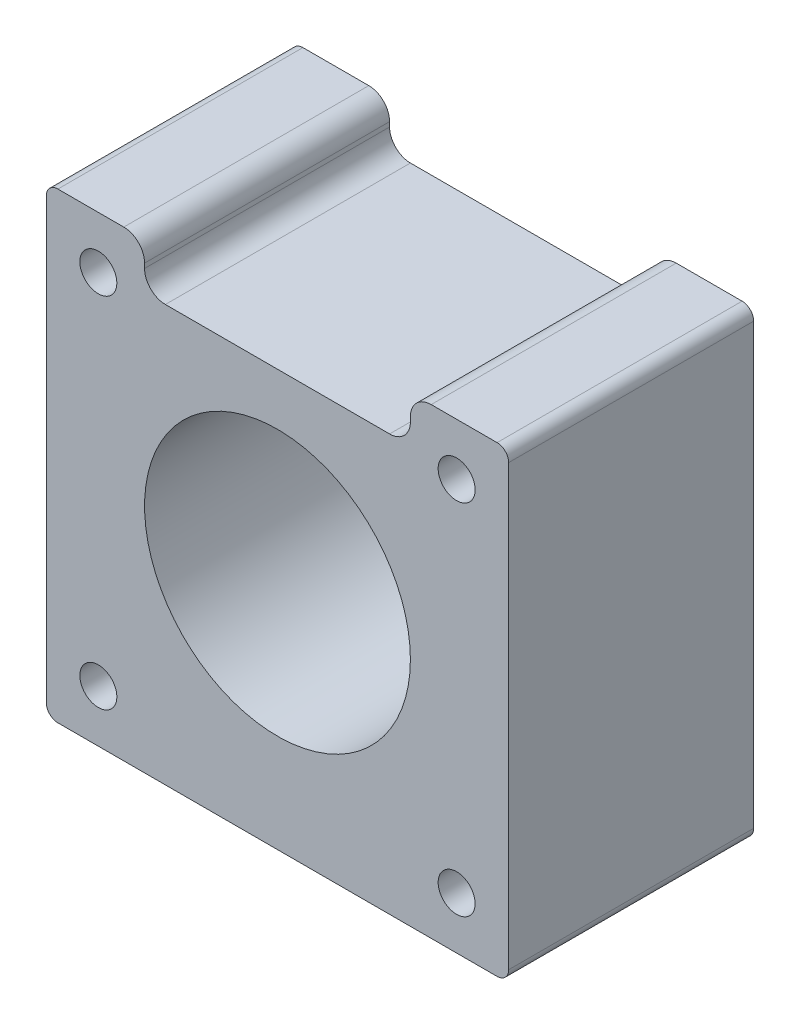
ISO-10303-21;
HEADER;
FILE_DESCRIPTION(('STEP AP214'),'2;1');
FILE_NAME('part.step','',(''),(''),'','','');
FILE_SCHEMA(('AUTOMOTIVE_DESIGN { 1 0 10303 214 1 1 1 1 }'));
ENDSEC;
DATA;
#1=APPLICATION_CONTEXT('core data for automotive mechanical design processes');
#2=APPLICATION_PROTOCOL_DEFINITION('international standard','automotive_design',2000,#1);
#3=PRODUCT_CONTEXT('',#1,'mechanical');
#4=PRODUCT('Part','Part','',(#3));
#5=PRODUCT_RELATED_PRODUCT_CATEGORY('part','',(#4));
#6=PRODUCT_DEFINITION_FORMATION('','',#4);
#7=PRODUCT_DEFINITION_CONTEXT('part definition',#1,'design');
#8=PRODUCT_DEFINITION('design','',#6,#7);
#9=PRODUCT_DEFINITION_SHAPE('','',#8);
#10=(LENGTH_UNIT() NAMED_UNIT(*) SI_UNIT(.MILLI.,.METRE.));
#11=(NAMED_UNIT(*) PLANE_ANGLE_UNIT() SI_UNIT($,.RADIAN.));
#12=(NAMED_UNIT(*) SI_UNIT($,.STERADIAN.) SOLID_ANGLE_UNIT());
#13=UNCERTAINTY_MEASURE_WITH_UNIT(LENGTH_MEASURE(1.E-05),#10,'distance_accuracy_value','');
#14=(GEOMETRIC_REPRESENTATION_CONTEXT(3) GLOBAL_UNCERTAINTY_ASSIGNED_CONTEXT((#13)) GLOBAL_UNIT_ASSIGNED_CONTEXT((#10,
#11,#12)) REPRESENTATION_CONTEXT('',''));
#15=CARTESIAN_POINT('',(0.,0.,0.));
#16=DIRECTION('',(0.,0.,1.));
#17=DIRECTION('',(1.,0.,0.));
#18=AXIS2_PLACEMENT_3D('',#15,#16,#17);
#19=CARTESIAN_POINT('',(-19.,-19.,21.2));
#20=DIRECTION('',(0.,0.,1.));
#21=DIRECTION('',(1.,0.,0.));
#22=AXIS2_PLACEMENT_3D('',#19,#20,#21);
#23=PLANE('',#22);
#24=CARTESIAN_POINT('',(15.5,-15.5,21.2));
#25=DIRECTION('',(0.,0.,1.));
#26=DIRECTION('',(1.,0.,0.));
#27=AXIS2_PLACEMENT_3D('',#24,#25,#26);
#28=CIRCLE('',#27,1.6);
#29=CARTESIAN_POINT('',(17.1,-15.5,21.2));
#30=VERTEX_POINT('',#29);
#31=EDGE_CURVE('E347',#30,#30,#28,.T.);
#32=ORIENTED_EDGE('',*,*,#31,.F.);
#33=EDGE_LOOP('',(#32));
#34=FACE_BOUND('',#33,.T.);
#35=CARTESIAN_POINT('',(-15.5,15.5,21.2));
#36=DIRECTION('',(0.,0.,1.));
#37=DIRECTION('',(1.,0.,0.));
#38=AXIS2_PLACEMENT_3D('',#35,#36,#37);
#39=CIRCLE('',#38,1.6);
#40=CARTESIAN_POINT('',(-13.9,15.5,21.2));
#41=VERTEX_POINT('',#40);
#42=EDGE_CURVE('E359',#41,#41,#39,.T.);
#43=ORIENTED_EDGE('',*,*,#42,.F.);
#44=EDGE_LOOP('',(#43));
#45=FACE_BOUND('',#44,.T.);
#46=CARTESIAN_POINT('',(-19.,-19.,21.2));
#47=DIRECTION('',(0.,0.,1.));
#48=DIRECTION('',(1.,0.,0.));
#49=AXIS2_PLACEMENT_3D('',#46,#47,#48);
#50=CIRCLE('',#49,1.);
#51=CARTESIAN_POINT('',(-20.,-19.,21.2));
#52=VERTEX_POINT('',#51);
#53=CARTESIAN_POINT('',(-19.,-20.,21.2));
#54=VERTEX_POINT('',#53);
#55=EDGE_CURVE('E208',#52,#54,#50,.T.);
#56=ORIENTED_EDGE('',*,*,#55,.T.);
#57=DIRECTION('',(1.,0.,0.));
#58=VECTOR('',#57,1.);
#59=CARTESIAN_POINT('',(-19.,-20.,21.2));
#60=LINE('',#59,#58);
#61=CARTESIAN_POINT('',(19.,-20.,21.2));
#62=VERTEX_POINT('',#61);
#63=EDGE_CURVE('E116',#54,#62,#60,.T.);
#64=ORIENTED_EDGE('',*,*,#63,.T.);
#65=CARTESIAN_POINT('',(19.,-19.,21.2));
#66=DIRECTION('',(0.,0.,1.));
#67=DIRECTION('',(1.,0.,0.));
#68=AXIS2_PLACEMENT_3D('',#65,#66,#67);
#69=CIRCLE('',#68,1.);
#70=CARTESIAN_POINT('',(20.,-19.,21.2));
#71=VERTEX_POINT('',#70);
#72=EDGE_CURVE('E247',#62,#71,#69,.T.);
#73=ORIENTED_EDGE('',*,*,#72,.T.);
#74=DIRECTION('',(0.,1.,0.));
#75=VECTOR('',#74,1.);
#76=CARTESIAN_POINT('',(20.,19.,21.2));
#77=LINE('',#76,#75);
#78=CARTESIAN_POINT('',(20.,19.,21.2));
#79=VERTEX_POINT('',#78);
#80=EDGE_CURVE('E266',#71,#79,#77,.T.);
#81=ORIENTED_EDGE('',*,*,#80,.T.);
#82=CARTESIAN_POINT('',(19.,19.,21.2));
#83=DIRECTION('',(0.,0.,1.));
#84=DIRECTION('',(1.,0.,0.));
#85=AXIS2_PLACEMENT_3D('',#82,#83,#84);
#86=CIRCLE('',#85,1.);
#87=CARTESIAN_POINT('',(19.,20.,21.2));
#88=VERTEX_POINT('',#87);
#89=EDGE_CURVE('E263',#79,#88,#86,.T.);
#90=ORIENTED_EDGE('',*,*,#89,.T.);
#91=DIRECTION('',(-1.,0.,0.));
#92=VECTOR('',#91,1.);
#93=CARTESIAN_POINT('',(13.3,20.,21.2));
#94=LINE('',#93,#92);
#95=CARTESIAN_POINT('',(13.3,20.,21.2));
#96=VERTEX_POINT('',#95);
#97=EDGE_CURVE('E265',#88,#96,#94,.T.);
#98=ORIENTED_EDGE('',*,*,#97,.T.);
#99=CARTESIAN_POINT('',(13.3,18.2,21.2));
#100=DIRECTION('',(0.,0.,1.));
#101=DIRECTION('',(1.,0.,0.));
#102=AXIS2_PLACEMENT_3D('',#99,#100,#101);
#103=CIRCLE('',#102,1.8);
#104=CARTESIAN_POINT('',(11.5,18.2,21.2));
#105=VERTEX_POINT('',#104);
#106=EDGE_CURVE('E268',#96,#105,#103,.T.);
#107=ORIENTED_EDGE('',*,*,#106,.T.);
#108=DIRECTION('',(0.,-1.,0.));
#109=VECTOR('',#108,1.);
#110=CARTESIAN_POINT('',(11.5,17.8,21.2));
#111=LINE('',#110,#109);
#112=CARTESIAN_POINT('',(11.5,17.8,21.2));
#113=VERTEX_POINT('',#112);
#114=EDGE_CURVE('E274',#105,#113,#111,.T.);
#115=ORIENTED_EDGE('',*,*,#114,.T.);
#116=CARTESIAN_POINT('',(9.7,17.8,21.2));
#117=DIRECTION('',(0.,0.,-1.));
#118=DIRECTION('',(-1.,0.,0.));
#119=AXIS2_PLACEMENT_3D('',#116,#117,#118);
#120=CIRCLE('',#119,1.8);
#121=CARTESIAN_POINT('',(9.69999999999999,16.,21.2));
#122=VERTEX_POINT('',#121);
#123=EDGE_CURVE('E276',#113,#122,#120,.T.);
#124=ORIENTED_EDGE('',*,*,#123,.T.);
#125=DIRECTION('',(-1.,0.,0.));
#126=VECTOR('',#125,1.);
#127=CARTESIAN_POINT('',(-9.69999999999999,16.,21.2));
#128=LINE('',#127,#126);
#129=CARTESIAN_POINT('',(-9.69999999999999,16.,21.2));
#130=VERTEX_POINT('',#129);
#131=EDGE_CURVE('E278',#122,#130,#128,.T.);
#132=ORIENTED_EDGE('',*,*,#131,.T.);
#133=CARTESIAN_POINT('',(-9.7,17.8,21.2));
#134=DIRECTION('',(0.,0.,-1.));
#135=DIRECTION('',(-1.,0.,0.));
#136=AXIS2_PLACEMENT_3D('',#133,#134,#135);
#137=CIRCLE('',#136,1.8);
#138=CARTESIAN_POINT('',(-11.5,17.8,21.2));
#139=VERTEX_POINT('',#138);
#140=EDGE_CURVE('E280',#130,#139,#137,.T.);
#141=ORIENTED_EDGE('',*,*,#140,.T.);
#142=DIRECTION('',(0.,1.,0.));
#143=VECTOR('',#142,1.);
#144=CARTESIAN_POINT('',(-11.5,17.8,21.2));
#145=LINE('',#144,#143);
#146=CARTESIAN_POINT('',(-11.5,18.2,21.2));
#147=VERTEX_POINT('',#146);
#148=EDGE_CURVE('E282',#139,#147,#145,.T.);
#149=ORIENTED_EDGE('',*,*,#148,.T.);
#150=CARTESIAN_POINT('',(-13.3,18.2,21.2));
#151=DIRECTION('',(0.,0.,1.));
#152=DIRECTION('',(-1.,0.,0.));
#153=AXIS2_PLACEMENT_3D('',#150,#151,#152);
#154=CIRCLE('',#153,1.8);
#155=CARTESIAN_POINT('',(-13.3,20.,21.2));
#156=VERTEX_POINT('',#155);
#157=EDGE_CURVE('E159',#147,#156,#154,.T.);
#158=ORIENTED_EDGE('',*,*,#157,.T.);
#159=DIRECTION('',(-1.,0.,0.));
#160=VECTOR('',#159,1.);
#161=CARTESIAN_POINT('',(-19.,20.,21.2));
#162=LINE('',#161,#160);
#163=CARTESIAN_POINT('',(-19.,20.,21.2));
#164=VERTEX_POINT('',#163);
#165=EDGE_CURVE('E153',#156,#164,#162,.T.);
#166=ORIENTED_EDGE('',*,*,#165,.T.);
#167=CARTESIAN_POINT('',(-19.,19.,21.2));
#168=DIRECTION('',(0.,0.,1.));
#169=DIRECTION('',(-1.,0.,0.));
#170=AXIS2_PLACEMENT_3D('',#167,#168,#169);
#171=CIRCLE('',#170,1.);
#172=CARTESIAN_POINT('',(-20.,19.,21.2));
#173=VERTEX_POINT('',#172);
#174=EDGE_CURVE('E157',#164,#173,#171,.T.);
#175=ORIENTED_EDGE('',*,*,#174,.T.);
#176=DIRECTION('',(0.,-1.,0.));
#177=VECTOR('',#176,1.);
#178=CARTESIAN_POINT('',(-20.,19.,21.2));
#179=LINE('',#178,#177);
#180=EDGE_CURVE('E49',#173,#52,#179,.T.);
#181=ORIENTED_EDGE('',*,*,#180,.T.);
#182=EDGE_LOOP('',(#56,#64,#73,#81,#90,#98,#107,#115,#124,#132,#141,#149,#158,#166,#175,#181));
#183=FACE_BOUND('',#182,.T.);
#184=CARTESIAN_POINT('',(0.,0.,21.2));
#185=DIRECTION('',(0.,0.,1.));
#186=DIRECTION('',(1.,0.,0.));
#187=AXIS2_PLACEMENT_3D('',#184,#185,#186);
#188=CIRCLE('',#187,11.5);
#189=CARTESIAN_POINT('',(11.5,0.,21.2));
#190=VERTEX_POINT('',#189);
#191=EDGE_CURVE('E181',#190,#190,#188,.T.);
#192=ORIENTED_EDGE('',*,*,#191,.F.);
#193=EDGE_LOOP('',(#192));
#194=FACE_BOUND('',#193,.T.);
#195=CARTESIAN_POINT('',(15.5,15.5,21.2));
#196=DIRECTION('',(0.,0.,1.));
#197=DIRECTION('',(1.,0.,0.));
#198=AXIS2_PLACEMENT_3D('',#195,#196,#197);
#199=CIRCLE('',#198,1.6);
#200=CARTESIAN_POINT('',(17.1,15.5,21.2));
#201=VERTEX_POINT('',#200);
#202=EDGE_CURVE('E353',#201,#201,#199,.T.);
#203=ORIENTED_EDGE('',*,*,#202,.F.);
#204=EDGE_LOOP('',(#203));
#205=FACE_BOUND('',#204,.T.);
#206=CARTESIAN_POINT('',(-15.5,-15.5,21.2));
#207=DIRECTION('',(0.,0.,1.));
#208=DIRECTION('',(1.,0.,0.));
#209=AXIS2_PLACEMENT_3D('',#206,#207,#208);
#210=CIRCLE('',#209,1.6);
#211=CARTESIAN_POINT('',(-13.9,-15.5,21.2));
#212=VERTEX_POINT('',#211);
#213=EDGE_CURVE('E338',#212,#212,#210,.T.);
#214=ORIENTED_EDGE('',*,*,#213,.F.);
#215=EDGE_LOOP('',(#214));
#216=FACE_BOUND('',#215,.T.);
#217=ADVANCED_FACE('F32',(#34,#45,#183,#194,#205,#216),#23,.T.);
#218=CARTESIAN_POINT('',(-19.,-19.,0.));
#219=DIRECTION('',(0.,0.,1.));
#220=DIRECTION('',(1.,0.,0.));
#221=AXIS2_PLACEMENT_3D('',#218,#219,#220);
#222=PLANE('',#221);
#223=CARTESIAN_POINT('',(15.5,-15.5,0.));
#224=DIRECTION('',(0.,0.,1.));
#225=DIRECTION('',(1.,0.,0.));
#226=AXIS2_PLACEMENT_3D('',#223,#224,#225);
#227=CIRCLE('',#226,1.6);
#228=CARTESIAN_POINT('',(17.1,-15.5,0.));
#229=VERTEX_POINT('',#228);
#230=EDGE_CURVE('E344',#229,#229,#227,.T.);
#231=ORIENTED_EDGE('',*,*,#230,.T.);
#232=EDGE_LOOP('',(#231));
#233=FACE_BOUND('',#232,.T.);
#234=CARTESIAN_POINT('',(-15.5,15.5,0.));
#235=DIRECTION('',(0.,0.,1.));
#236=DIRECTION('',(1.,0.,0.));
#237=AXIS2_PLACEMENT_3D('',#234,#235,#236);
#238=CIRCLE('',#237,1.6);
#239=CARTESIAN_POINT('',(-13.9,15.5,0.));
#240=VERTEX_POINT('',#239);
#241=EDGE_CURVE('E356',#240,#240,#238,.T.);
#242=ORIENTED_EDGE('',*,*,#241,.T.);
#243=EDGE_LOOP('',(#242));
#244=FACE_BOUND('',#243,.T.);
#245=CARTESIAN_POINT('',(-19.,-19.,0.));
#246=DIRECTION('',(0.,0.,1.));
#247=DIRECTION('',(1.,0.,0.));
#248=AXIS2_PLACEMENT_3D('',#245,#246,#247);
#249=CIRCLE('',#248,1.);
#250=CARTESIAN_POINT('',(-20.,-19.,0.));
#251=VERTEX_POINT('',#250);
#252=CARTESIAN_POINT('',(-19.,-20.,0.));
#253=VERTEX_POINT('',#252);
#254=EDGE_CURVE('E177',#251,#253,#249,.T.);
#255=ORIENTED_EDGE('',*,*,#254,.F.);
#256=DIRECTION('',(0.,-1.,0.));
#257=VECTOR('',#256,1.);
#258=CARTESIAN_POINT('',(-20.,19.,0.));
#259=LINE('',#258,#257);
#260=CARTESIAN_POINT('',(-20.,19.,0.));
#261=VERTEX_POINT('',#260);
#262=EDGE_CURVE('E108',#261,#251,#259,.T.);
#263=ORIENTED_EDGE('',*,*,#262,.F.);
#264=CARTESIAN_POINT('',(-19.,19.,0.));
#265=DIRECTION('',(0.,0.,1.));
#266=DIRECTION('',(-1.,0.,0.));
#267=AXIS2_PLACEMENT_3D('',#264,#265,#266);
#268=CIRCLE('',#267,1.);
#269=CARTESIAN_POINT('',(-19.,20.,0.));
#270=VERTEX_POINT('',#269);
#271=EDGE_CURVE('E102',#270,#261,#268,.T.);
#272=ORIENTED_EDGE('',*,*,#271,.F.);
#273=DIRECTION('',(-1.,0.,0.));
#274=VECTOR('',#273,1.);
#275=CARTESIAN_POINT('',(-19.,20.,0.));
#276=LINE('',#275,#274);
#277=CARTESIAN_POINT('',(-13.3,20.,0.));
#278=VERTEX_POINT('',#277);
#279=EDGE_CURVE('E167',#278,#270,#276,.T.);
#280=ORIENTED_EDGE('',*,*,#279,.F.);
#281=CARTESIAN_POINT('',(-13.3,18.2,0.));
#282=DIRECTION('',(0.,0.,1.));
#283=DIRECTION('',(-1.,0.,0.));
#284=AXIS2_PLACEMENT_3D('',#281,#282,#283);
#285=CIRCLE('',#284,1.8);
#286=CARTESIAN_POINT('',(-11.5,18.2,0.));
#287=VERTEX_POINT('',#286);
#288=EDGE_CURVE('E203',#287,#278,#285,.T.);
#289=ORIENTED_EDGE('',*,*,#288,.F.);
#290=DIRECTION('',(0.,1.,0.));
#291=VECTOR('',#290,1.);
#292=CARTESIAN_POINT('',(-11.5,17.8,0.));
#293=LINE('',#292,#291);
#294=CARTESIAN_POINT('',(-11.5,17.8,0.));
#295=VERTEX_POINT('',#294);
#296=EDGE_CURVE('E201',#295,#287,#293,.T.);
#297=ORIENTED_EDGE('',*,*,#296,.F.);
#298=CARTESIAN_POINT('',(-9.7,17.8,0.));
#299=DIRECTION('',(0.,0.,-1.));
#300=DIRECTION('',(-1.,0.,0.));
#301=AXIS2_PLACEMENT_3D('',#298,#299,#300);
#302=CIRCLE('',#301,1.8);
#303=CARTESIAN_POINT('',(-9.69999999999999,16.,0.));
#304=VERTEX_POINT('',#303);
#305=EDGE_CURVE('E199',#304,#295,#302,.T.);
#306=ORIENTED_EDGE('',*,*,#305,.F.);
#307=DIRECTION('',(-1.,0.,0.));
#308=VECTOR('',#307,1.);
#309=CARTESIAN_POINT('',(-9.69999999999999,16.,0.));
#310=LINE('',#309,#308);
#311=CARTESIAN_POINT('',(9.69999999999999,16.,0.));
#312=VERTEX_POINT('',#311);
#313=EDGE_CURVE('E197',#312,#304,#310,.T.);
#314=ORIENTED_EDGE('',*,*,#313,.F.);
#315=CARTESIAN_POINT('',(9.7,17.8,0.));
#316=DIRECTION('',(0.,0.,-1.));
#317=DIRECTION('',(-1.,0.,0.));
#318=AXIS2_PLACEMENT_3D('',#315,#316,#317);
#319=CIRCLE('',#318,1.8);
#320=CARTESIAN_POINT('',(11.5,17.8,0.));
#321=VERTEX_POINT('',#320);
#322=EDGE_CURVE('E195',#321,#312,#319,.T.);
#323=ORIENTED_EDGE('',*,*,#322,.F.);
#324=DIRECTION('',(0.,-1.,0.));
#325=VECTOR('',#324,1.);
#326=CARTESIAN_POINT('',(11.5,17.8,0.));
#327=LINE('',#326,#325);
#328=CARTESIAN_POINT('',(11.5,18.2,0.));
#329=VERTEX_POINT('',#328);
#330=EDGE_CURVE('E193',#329,#321,#327,.T.);
#331=ORIENTED_EDGE('',*,*,#330,.F.);
#332=CARTESIAN_POINT('',(13.3,18.2,0.));
#333=DIRECTION('',(0.,0.,1.));
#334=DIRECTION('',(1.,0.,0.));
#335=AXIS2_PLACEMENT_3D('',#332,#333,#334);
#336=CIRCLE('',#335,1.8);
#337=CARTESIAN_POINT('',(13.3,20.,0.));
#338=VERTEX_POINT('',#337);
#339=EDGE_CURVE('E191',#338,#329,#336,.T.);
#340=ORIENTED_EDGE('',*,*,#339,.F.);
#341=DIRECTION('',(-1.,0.,0.));
#342=VECTOR('',#341,1.);
#343=CARTESIAN_POINT('',(13.3,20.,0.));
#344=LINE('',#343,#342);
#345=CARTESIAN_POINT('',(19.,20.,0.));
#346=VERTEX_POINT('',#345);
#347=EDGE_CURVE('E189',#346,#338,#344,.T.);
#348=ORIENTED_EDGE('',*,*,#347,.F.);
#349=CARTESIAN_POINT('',(19.,19.,0.));
#350=DIRECTION('',(0.,0.,1.));
#351=DIRECTION('',(1.,0.,0.));
#352=AXIS2_PLACEMENT_3D('',#349,#350,#351);
#353=CIRCLE('',#352,1.);
#354=CARTESIAN_POINT('',(20.,19.,0.));
#355=VERTEX_POINT('',#354);
#356=EDGE_CURVE('E187',#355,#346,#353,.T.);
#357=ORIENTED_EDGE('',*,*,#356,.F.);
#358=DIRECTION('',(0.,1.,0.));
#359=VECTOR('',#358,1.);
#360=CARTESIAN_POINT('',(20.,19.,0.));
#361=LINE('',#360,#359);
#362=CARTESIAN_POINT('',(20.,-19.,0.));
#363=VERTEX_POINT('',#362);
#364=EDGE_CURVE('E185',#363,#355,#361,.T.);
#365=ORIENTED_EDGE('',*,*,#364,.F.);
#366=CARTESIAN_POINT('',(19.,-19.,0.));
#367=DIRECTION('',(0.,0.,1.));
#368=DIRECTION('',(1.,0.,0.));
#369=AXIS2_PLACEMENT_3D('',#366,#367,#368);
#370=CIRCLE('',#369,1.);
#371=CARTESIAN_POINT('',(19.,-20.,0.));
#372=VERTEX_POINT('',#371);
#373=EDGE_CURVE('E183',#372,#363,#370,.T.);
#374=ORIENTED_EDGE('',*,*,#373,.F.);
#375=DIRECTION('',(1.,0.,0.));
#376=VECTOR('',#375,1.);
#377=CARTESIAN_POINT('',(-19.,-20.,0.));
#378=LINE('',#377,#376);
#379=EDGE_CURVE('E180',#253,#372,#378,.T.);
#380=ORIENTED_EDGE('',*,*,#379,.F.);
#381=EDGE_LOOP('',(#255,#263,#272,#280,#289,#297,#306,#314,#323,#331,#340,#348,#357,#365,#374,#380));
#382=FACE_BOUND('',#381,.T.);
#383=CARTESIAN_POINT('',(0.,0.,0.));
#384=DIRECTION('',(0.,0.,1.));
#385=DIRECTION('',(1.,0.,0.));
#386=AXIS2_PLACEMENT_3D('',#383,#384,#385);
#387=CIRCLE('',#386,11.5);
#388=CARTESIAN_POINT('',(11.5,0.,0.));
#389=VERTEX_POINT('',#388);
#390=EDGE_CURVE('E362',#389,#389,#387,.T.);
#391=ORIENTED_EDGE('',*,*,#390,.T.);
#392=EDGE_LOOP('',(#391));
#393=FACE_BOUND('',#392,.T.);
#394=CARTESIAN_POINT('',(15.5,15.5,0.));
#395=DIRECTION('',(0.,0.,1.));
#396=DIRECTION('',(1.,0.,0.));
#397=AXIS2_PLACEMENT_3D('',#394,#395,#396);
#398=CIRCLE('',#397,1.6);
#399=CARTESIAN_POINT('',(17.1,15.5,0.));
#400=VERTEX_POINT('',#399);
#401=EDGE_CURVE('E350',#400,#400,#398,.T.);
#402=ORIENTED_EDGE('',*,*,#401,.T.);
#403=EDGE_LOOP('',(#402));
#404=FACE_BOUND('',#403,.T.);
#405=CARTESIAN_POINT('',(-15.5,-15.5,0.));
#406=DIRECTION('',(0.,0.,1.));
#407=DIRECTION('',(1.,0.,0.));
#408=AXIS2_PLACEMENT_3D('',#405,#406,#407);
#409=CIRCLE('',#408,1.6);
#410=CARTESIAN_POINT('',(-13.9,-15.5,0.));
#411=VERTEX_POINT('',#410);
#412=EDGE_CURVE('E341',#411,#411,#409,.T.);
#413=ORIENTED_EDGE('',*,*,#412,.T.);
#414=EDGE_LOOP('',(#413));
#415=FACE_BOUND('',#414,.T.);
#416=ADVANCED_FACE('F251',(#233,#244,#382,#393,#404,#415),#222,.F.);
#417=CARTESIAN_POINT('',(-19.,-19.,21.2));
#418=DIRECTION('',(0.,0.,-1.));
#419=DIRECTION('',(-1.,0.,0.));
#420=AXIS2_PLACEMENT_3D('',#417,#418,#419);
#421=CYLINDRICAL_SURFACE('',#420,1.);
#422=ORIENTED_EDGE('',*,*,#254,.T.);
#423=DIRECTION('',(0.,0.,-1.));
#424=VECTOR('',#423,1.);
#425=CARTESIAN_POINT('',(-19.,-20.,21.2));
#426=LINE('',#425,#424);
#427=EDGE_CURVE('E11',#54,#253,#426,.T.);
#428=ORIENTED_EDGE('',*,*,#427,.F.);
#429=ORIENTED_EDGE('',*,*,#55,.F.);
#430=DIRECTION('',(0.,0.,-1.));
#431=VECTOR('',#430,1.);
#432=CARTESIAN_POINT('',(-20.,-19.,21.2));
#433=LINE('',#432,#431);
#434=EDGE_CURVE('E173',#52,#251,#433,.T.);
#435=ORIENTED_EDGE('',*,*,#434,.T.);
#436=EDGE_LOOP('',(#422,#428,#429,#435));
#437=FACE_BOUND('',#436,.T.);
#438=ADVANCED_FACE('F34',(#437),#421,.T.);
#439=CARTESIAN_POINT('',(-19.,-20.,21.2));
#440=DIRECTION('',(0.,1.,0.));
#441=DIRECTION('',(0.,0.,1.));
#442=AXIS2_PLACEMENT_3D('',#439,#440,#441);
#443=PLANE('',#442);
#444=ORIENTED_EDGE('',*,*,#379,.T.);
#445=DIRECTION('',(0.,0.,-1.));
#446=VECTOR('',#445,1.);
#447=CARTESIAN_POINT('',(19.,-20.,21.2));
#448=LINE('',#447,#446);
#449=EDGE_CURVE('E41',#62,#372,#448,.T.);
#450=ORIENTED_EDGE('',*,*,#449,.F.);
#451=ORIENTED_EDGE('',*,*,#63,.F.);
#452=ORIENTED_EDGE('',*,*,#427,.T.);
#453=EDGE_LOOP('',(#444,#450,#451,#452));
#454=FACE_BOUND('',#453,.T.);
#455=ADVANCED_FACE('F520',(#454),#443,.F.);
#456=CARTESIAN_POINT('',(19.,-19.,21.2));
#457=DIRECTION('',(0.,0.,-1.));
#458=DIRECTION('',(-1.,0.,0.));
#459=AXIS2_PLACEMENT_3D('',#456,#457,#458);
#460=CYLINDRICAL_SURFACE('',#459,1.);
#461=ORIENTED_EDGE('',*,*,#373,.T.);
#462=DIRECTION('',(0.,0.,-1.));
#463=VECTOR('',#462,1.);
#464=CARTESIAN_POINT('',(20.,-19.,21.2));
#465=LINE('',#464,#463);
#466=EDGE_CURVE('E239',#71,#363,#465,.T.);
#467=ORIENTED_EDGE('',*,*,#466,.F.);
#468=ORIENTED_EDGE('',*,*,#72,.F.);
#469=ORIENTED_EDGE('',*,*,#449,.T.);
#470=EDGE_LOOP('',(#461,#467,#468,#469));
#471=FACE_BOUND('',#470,.T.);
#472=ADVANCED_FACE('F245',(#471),#460,.T.);
#473=CARTESIAN_POINT('',(20.,19.,21.2));
#474=DIRECTION('',(-1.,0.,0.));
#475=DIRECTION('',(0.,0.,1.));
#476=AXIS2_PLACEMENT_3D('',#473,#474,#475);
#477=PLANE('',#476);
#478=ORIENTED_EDGE('',*,*,#364,.T.);
#479=DIRECTION('',(0.,0.,-1.));
#480=VECTOR('',#479,1.);
#481=CARTESIAN_POINT('',(20.,19.,21.2));
#482=LINE('',#481,#480);
#483=EDGE_CURVE('E236',#79,#355,#482,.T.);
#484=ORIENTED_EDGE('',*,*,#483,.F.);
#485=ORIENTED_EDGE('',*,*,#80,.F.);
#486=ORIENTED_EDGE('',*,*,#466,.T.);
#487=EDGE_LOOP('',(#478,#484,#485,#486));
#488=FACE_BOUND('',#487,.T.);
#489=ADVANCED_FACE('F257',(#488),#477,.F.);
#490=CARTESIAN_POINT('',(19.,19.,21.2));
#491=DIRECTION('',(0.,0.,-1.));
#492=DIRECTION('',(-1.,0.,0.));
#493=AXIS2_PLACEMENT_3D('',#490,#491,#492);
#494=CYLINDRICAL_SURFACE('',#493,1.);
#495=ORIENTED_EDGE('',*,*,#356,.T.);
#496=DIRECTION('',(0.,0.,-1.));
#497=VECTOR('',#496,1.);
#498=CARTESIAN_POINT('',(19.,20.,21.2));
#499=LINE('',#498,#497);
#500=EDGE_CURVE('E233',#88,#346,#499,.T.);
#501=ORIENTED_EDGE('',*,*,#500,.F.);
#502=ORIENTED_EDGE('',*,*,#89,.F.);
#503=ORIENTED_EDGE('',*,*,#483,.T.);
#504=EDGE_LOOP('',(#495,#501,#502,#503));
#505=FACE_BOUND('',#504,.T.);
#506=ADVANCED_FACE('F261',(#505),#494,.T.);
#507=CARTESIAN_POINT('',(13.3,20.,21.2));
#508=DIRECTION('',(0.,-1.,0.));
#509=DIRECTION('',(0.,0.,-1.));
#510=AXIS2_PLACEMENT_3D('',#507,#508,#509);
#511=PLANE('',#510);
#512=ORIENTED_EDGE('',*,*,#347,.T.);
#513=DIRECTION('',(0.,0.,-1.));
#514=VECTOR('',#513,1.);
#515=CARTESIAN_POINT('',(13.3,20.,21.2));
#516=LINE('',#515,#514);
#517=EDGE_CURVE('E230',#96,#338,#516,.T.);
#518=ORIENTED_EDGE('',*,*,#517,.F.);
#519=ORIENTED_EDGE('',*,*,#97,.F.);
#520=ORIENTED_EDGE('',*,*,#500,.T.);
#521=EDGE_LOOP('',(#512,#518,#519,#520));
#522=FACE_BOUND('',#521,.T.);
#523=ADVANCED_FACE('F485',(#522),#511,.F.);
#524=CARTESIAN_POINT('',(13.3,18.2,21.2));
#525=DIRECTION('',(0.,0.,-1.));
#526=DIRECTION('',(-1.,0.,0.));
#527=AXIS2_PLACEMENT_3D('',#524,#525,#526);
#528=CYLINDRICAL_SURFACE('',#527,1.8);
#529=ORIENTED_EDGE('',*,*,#339,.T.);
#530=DIRECTION('',(0.,0.,-1.));
#531=VECTOR('',#530,1.);
#532=CARTESIAN_POINT('',(11.5,18.2,21.2));
#533=LINE('',#532,#531);
#534=EDGE_CURVE('E227',#105,#329,#533,.T.);
#535=ORIENTED_EDGE('',*,*,#534,.F.);
#536=ORIENTED_EDGE('',*,*,#106,.F.);
#537=ORIENTED_EDGE('',*,*,#517,.T.);
#538=EDGE_LOOP('',(#529,#535,#536,#537));
#539=FACE_BOUND('',#538,.T.);
#540=ADVANCED_FACE('F475',(#539),#528,.T.);
#541=CARTESIAN_POINT('',(11.5,17.8,21.2));
#542=DIRECTION('',(1.,0.,0.));
#543=DIRECTION('',(0.,0.,-1.));
#544=AXIS2_PLACEMENT_3D('',#541,#542,#543);
#545=PLANE('',#544);
#546=ORIENTED_EDGE('',*,*,#330,.T.);
#547=DIRECTION('',(0.,0.,-1.));
#548=VECTOR('',#547,1.);
#549=CARTESIAN_POINT('',(11.5,17.8,21.2));
#550=LINE('',#549,#548);
#551=EDGE_CURVE('E224',#113,#321,#550,.T.);
#552=ORIENTED_EDGE('',*,*,#551,.F.);
#553=ORIENTED_EDGE('',*,*,#114,.F.);
#554=ORIENTED_EDGE('',*,*,#534,.T.);
#555=EDGE_LOOP('',(#546,#552,#553,#554));
#556=FACE_BOUND('',#555,.T.);
#557=ADVANCED_FACE('F465',(#556),#545,.F.);
#558=CARTESIAN_POINT('',(9.7,17.8,21.2));
#559=DIRECTION('',(0.,0.,-1.));
#560=DIRECTION('',(-1.,0.,0.));
#561=AXIS2_PLACEMENT_3D('',#558,#559,#560);
#562=CYLINDRICAL_SURFACE('',#561,1.8);
#563=ORIENTED_EDGE('',*,*,#322,.T.);
#564=DIRECTION('',(0.,0.,-1.));
#565=VECTOR('',#564,1.);
#566=CARTESIAN_POINT('',(9.69999999999999,16.,21.2));
#567=LINE('',#566,#565);
#568=EDGE_CURVE('E221',#122,#312,#567,.T.);
#569=ORIENTED_EDGE('',*,*,#568,.F.);
#570=ORIENTED_EDGE('',*,*,#123,.F.);
#571=ORIENTED_EDGE('',*,*,#551,.T.);
#572=EDGE_LOOP('',(#563,#569,#570,#571));
#573=FACE_BOUND('',#572,.T.);
#574=ADVANCED_FACE('F455',(#573),#562,.F.);
#575=CARTESIAN_POINT('',(-9.69999999999999,16.,21.2));
#576=DIRECTION('',(0.,-1.,0.));
#577=DIRECTION('',(0.,0.,-1.));
#578=AXIS2_PLACEMENT_3D('',#575,#576,#577);
#579=PLANE('',#578);
#580=ORIENTED_EDGE('',*,*,#313,.T.);
#581=DIRECTION('',(0.,0.,-1.));
#582=VECTOR('',#581,1.);
#583=CARTESIAN_POINT('',(-9.69999999999999,16.,21.2));
#584=LINE('',#583,#582);
#585=EDGE_CURVE('E218',#130,#304,#584,.T.);
#586=ORIENTED_EDGE('',*,*,#585,.F.);
#587=ORIENTED_EDGE('',*,*,#131,.F.);
#588=ORIENTED_EDGE('',*,*,#568,.T.);
#589=EDGE_LOOP('',(#580,#586,#587,#588));
#590=FACE_BOUND('',#589,.T.);
#591=ADVANCED_FACE('F445',(#590),#579,.F.);
#592=CARTESIAN_POINT('',(-9.7,17.8,21.2));
#593=DIRECTION('',(0.,0.,-1.));
#594=DIRECTION('',(-1.,0.,0.));
#595=AXIS2_PLACEMENT_3D('',#592,#593,#594);
#596=CYLINDRICAL_SURFACE('',#595,1.8);
#597=ORIENTED_EDGE('',*,*,#305,.T.);
#598=DIRECTION('',(0.,0.,-1.));
#599=VECTOR('',#598,1.);
#600=CARTESIAN_POINT('',(-11.5,17.8,21.2));
#601=LINE('',#600,#599);
#602=EDGE_CURVE('E215',#139,#295,#601,.T.);
#603=ORIENTED_EDGE('',*,*,#602,.F.);
#604=ORIENTED_EDGE('',*,*,#140,.F.);
#605=ORIENTED_EDGE('',*,*,#585,.T.);
#606=EDGE_LOOP('',(#597,#603,#604,#605));
#607=FACE_BOUND('',#606,.T.);
#608=ADVANCED_FACE('F436',(#607),#596,.F.);
#609=CARTESIAN_POINT('',(-11.5,17.8,21.2));
#610=DIRECTION('',(-1.,0.,0.));
#611=DIRECTION('',(0.,0.,1.));
#612=AXIS2_PLACEMENT_3D('',#609,#610,#611);
#613=PLANE('',#612);
#614=ORIENTED_EDGE('',*,*,#296,.T.);
#615=DIRECTION('',(0.,0.,-1.));
#616=VECTOR('',#615,1.);
#617=CARTESIAN_POINT('',(-11.5,18.2,21.2));
#618=LINE('',#617,#616);
#619=EDGE_CURVE('E212',#147,#287,#618,.T.);
#620=ORIENTED_EDGE('',*,*,#619,.F.);
#621=ORIENTED_EDGE('',*,*,#148,.F.);
#622=ORIENTED_EDGE('',*,*,#602,.T.);
#623=EDGE_LOOP('',(#614,#620,#621,#622));
#624=FACE_BOUND('',#623,.T.);
#625=ADVANCED_FACE('F288',(#624),#613,.F.);
#626=CARTESIAN_POINT('',(-13.3,18.2,21.2));
#627=DIRECTION('',(0.,0.,-1.));
#628=DIRECTION('',(-1.,0.,0.));
#629=AXIS2_PLACEMENT_3D('',#626,#627,#628);
#630=CYLINDRICAL_SURFACE('',#629,1.8);
#631=ORIENTED_EDGE('',*,*,#288,.T.);
#632=DIRECTION('',(0.,0.,-1.));
#633=VECTOR('',#632,1.);
#634=CARTESIAN_POINT('',(-13.3,20.,21.2));
#635=LINE('',#634,#633);
#636=EDGE_CURVE('E168',#156,#278,#635,.T.);
#637=ORIENTED_EDGE('',*,*,#636,.F.);
#638=ORIENTED_EDGE('',*,*,#157,.F.);
#639=ORIENTED_EDGE('',*,*,#619,.T.);
#640=EDGE_LOOP('',(#631,#637,#638,#639));
#641=FACE_BOUND('',#640,.T.);
#642=ADVANCED_FACE('F292',(#641),#630,.T.);
#643=CARTESIAN_POINT('',(-19.,20.,21.2));
#644=DIRECTION('',(0.,-1.,0.));
#645=DIRECTION('',(0.,0.,-1.));
#646=AXIS2_PLACEMENT_3D('',#643,#644,#645);
#647=PLANE('',#646);
#648=ORIENTED_EDGE('',*,*,#279,.T.);
#649=DIRECTION('',(0.,0.,-1.));
#650=VECTOR('',#649,1.);
#651=CARTESIAN_POINT('',(-19.,20.,21.2));
#652=LINE('',#651,#650);
#653=EDGE_CURVE('E164',#164,#270,#652,.T.);
#654=ORIENTED_EDGE('',*,*,#653,.F.);
#655=ORIENTED_EDGE('',*,*,#165,.F.);
#656=ORIENTED_EDGE('',*,*,#636,.T.);
#657=EDGE_LOOP('',(#648,#654,#655,#656));
#658=FACE_BOUND('',#657,.T.);
#659=ADVANCED_FACE('F165',(#658),#647,.F.);
#660=CARTESIAN_POINT('',(-19.,19.,21.2));
#661=DIRECTION('',(0.,0.,-1.));
#662=DIRECTION('',(-1.,0.,0.));
#663=AXIS2_PLACEMENT_3D('',#660,#661,#662);
#664=CYLINDRICAL_SURFACE('',#663,1.);
#665=ORIENTED_EDGE('',*,*,#271,.T.);
#666=DIRECTION('',(0.,0.,-1.));
#667=VECTOR('',#666,1.);
#668=CARTESIAN_POINT('',(-20.,19.,21.2));
#669=LINE('',#668,#667);
#670=EDGE_CURVE('E169',#173,#261,#669,.T.);
#671=ORIENTED_EDGE('',*,*,#670,.F.);
#672=ORIENTED_EDGE('',*,*,#174,.F.);
#673=ORIENTED_EDGE('',*,*,#653,.T.);
#674=EDGE_LOOP('',(#665,#671,#672,#673));
#675=FACE_BOUND('',#674,.T.);
#676=ADVANCED_FACE('F171',(#675),#664,.T.);
#677=CARTESIAN_POINT('',(-20.,19.,21.2));
#678=DIRECTION('',(1.,0.,0.));
#679=DIRECTION('',(0.,0.,-1.));
#680=AXIS2_PLACEMENT_3D('',#677,#678,#679);
#681=PLANE('',#680);
#682=ORIENTED_EDGE('',*,*,#262,.T.);
#683=ORIENTED_EDGE('',*,*,#434,.F.);
#684=ORIENTED_EDGE('',*,*,#180,.F.);
#685=ORIENTED_EDGE('',*,*,#670,.T.);
#686=EDGE_LOOP('',(#682,#683,#684,#685));
#687=FACE_BOUND('',#686,.T.);
#688=ADVANCED_FACE('F296',(#687),#681,.F.);
#689=CARTESIAN_POINT('',(0.,0.,21.2));
#690=DIRECTION('',(0.,0.,-1.));
#691=DIRECTION('',(-1.,0.,0.));
#692=AXIS2_PLACEMENT_3D('',#689,#690,#691);
#693=CYLINDRICAL_SURFACE('',#692,11.5);
#694=ORIENTED_EDGE('',*,*,#191,.T.);
#695=EDGE_LOOP('',(#694));
#696=FACE_BOUND('',#695,.T.);
#697=ORIENTED_EDGE('',*,*,#390,.F.);
#698=EDGE_LOOP('',(#697));
#699=FACE_BOUND('',#698,.T.);
#700=ADVANCED_FACE('F298',(#696,#699),#693,.F.);
#701=CARTESIAN_POINT('',(-15.5,15.5,21.2));
#702=DIRECTION('',(0.,0.,-1.));
#703=DIRECTION('',(-1.,0.,0.));
#704=AXIS2_PLACEMENT_3D('',#701,#702,#703);
#705=CYLINDRICAL_SURFACE('',#704,1.6);
#706=ORIENTED_EDGE('',*,*,#42,.T.);
#707=EDGE_LOOP('',(#706));
#708=FACE_BOUND('',#707,.T.);
#709=ORIENTED_EDGE('',*,*,#241,.F.);
#710=EDGE_LOOP('',(#709));
#711=FACE_BOUND('',#710,.T.);
#712=ADVANCED_FACE('F304',(#708,#711),#705,.F.);
#713=CARTESIAN_POINT('',(15.5,15.5,21.2));
#714=DIRECTION('',(0.,0.,-1.));
#715=DIRECTION('',(-1.,0.,0.));
#716=AXIS2_PLACEMENT_3D('',#713,#714,#715);
#717=CYLINDRICAL_SURFACE('',#716,1.6);
#718=ORIENTED_EDGE('',*,*,#202,.T.);
#719=EDGE_LOOP('',(#718));
#720=FACE_BOUND('',#719,.T.);
#721=ORIENTED_EDGE('',*,*,#401,.F.);
#722=EDGE_LOOP('',(#721));
#723=FACE_BOUND('',#722,.T.);
#724=ADVANCED_FACE('F321',(#720,#723),#717,.F.);
#725=CARTESIAN_POINT('',(15.5,-15.5,21.2));
#726=DIRECTION('',(0.,0.,-1.));
#727=DIRECTION('',(-1.,0.,0.));
#728=AXIS2_PLACEMENT_3D('',#725,#726,#727);
#729=CYLINDRICAL_SURFACE('',#728,1.6);
#730=ORIENTED_EDGE('',*,*,#31,.T.);
#731=EDGE_LOOP('',(#730));
#732=FACE_BOUND('',#731,.T.);
#733=ORIENTED_EDGE('',*,*,#230,.F.);
#734=EDGE_LOOP('',(#733));
#735=FACE_BOUND('',#734,.T.);
#736=ADVANCED_FACE('F325',(#732,#735),#729,.F.);
#737=CARTESIAN_POINT('',(-15.5,-15.5,21.2));
#738=DIRECTION('',(0.,0.,-1.));
#739=DIRECTION('',(-1.,0.,0.));
#740=AXIS2_PLACEMENT_3D('',#737,#738,#739);
#741=CYLINDRICAL_SURFACE('',#740,1.6);
#742=ORIENTED_EDGE('',*,*,#213,.T.);
#743=EDGE_LOOP('',(#742));
#744=FACE_BOUND('',#743,.T.);
#745=ORIENTED_EDGE('',*,*,#412,.F.);
#746=EDGE_LOOP('',(#745));
#747=FACE_BOUND('',#746,.T.);
#748=ADVANCED_FACE('F329',(#744,#747),#741,.F.);
#749=CLOSED_SHELL('',(#217,#416,#438,#455,#472,#489,#506,#523,#540,#557,#574,#591,#608,#625,
#642,#659,#676,#688,#700,#712,#724,#736,#748));
#750=MANIFOLD_SOLID_BREP('B2',#749);
#751=ADVANCED_BREP_SHAPE_REPRESENTATION('',(#18,#750),#14);
#752=SHAPE_DEFINITION_REPRESENTATION(#9,#751);
ENDSEC;
END-ISO-10303-21;
